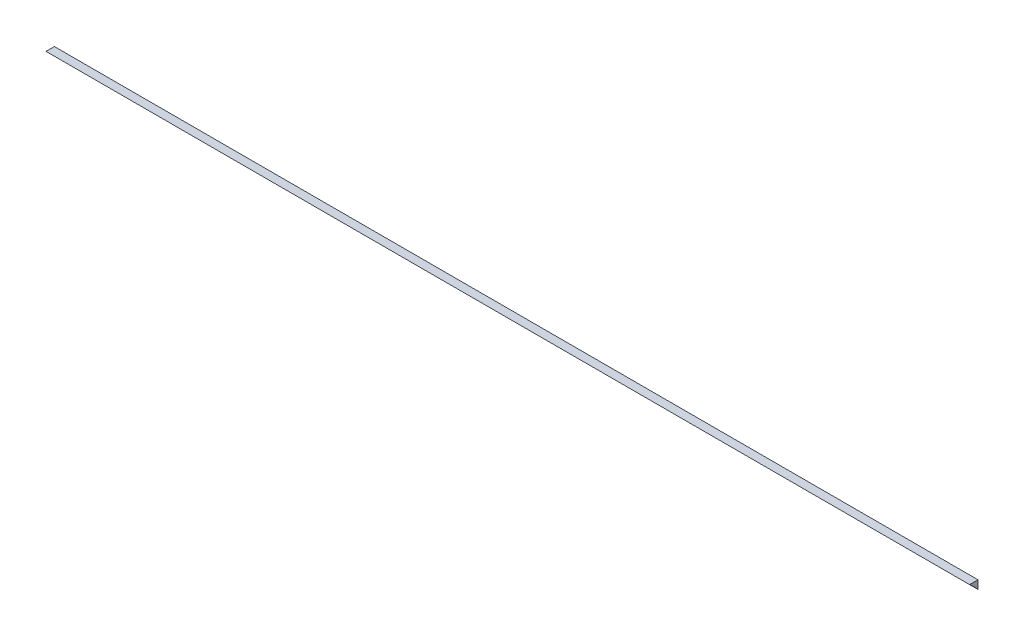
ISO-10303-21;
HEADER;
FILE_DESCRIPTION(('STEP AP214'),'2;1');
FILE_NAME('part.step','',(''),(''),'','','');
FILE_SCHEMA(('AUTOMOTIVE_DESIGN { 1 0 10303 214 1 1 1 1 }'));
ENDSEC;
DATA;
#1=APPLICATION_CONTEXT('core data for automotive mechanical design processes');
#2=APPLICATION_PROTOCOL_DEFINITION('international standard','automotive_design',2000,#1);
#3=PRODUCT_CONTEXT('',#1,'mechanical');
#4=PRODUCT('Part','Part','',(#3));
#5=PRODUCT_RELATED_PRODUCT_CATEGORY('part','',(#4));
#6=PRODUCT_DEFINITION_FORMATION('','',#4);
#7=PRODUCT_DEFINITION_CONTEXT('part definition',#1,'design');
#8=PRODUCT_DEFINITION('design','',#6,#7);
#9=PRODUCT_DEFINITION_SHAPE('','',#8);
#10=(LENGTH_UNIT() NAMED_UNIT(*) SI_UNIT(.MILLI.,.METRE.));
#11=(NAMED_UNIT(*) PLANE_ANGLE_UNIT() SI_UNIT($,.RADIAN.));
#12=(NAMED_UNIT(*) SI_UNIT($,.STERADIAN.) SOLID_ANGLE_UNIT());
#13=UNCERTAINTY_MEASURE_WITH_UNIT(LENGTH_MEASURE(1.E-05),#10,'distance_accuracy_value','');
#14=(GEOMETRIC_REPRESENTATION_CONTEXT(3) GLOBAL_UNCERTAINTY_ASSIGNED_CONTEXT((#13)) GLOBAL_UNIT_ASSIGNED_CONTEXT((#10,
#11,#12)) REPRESENTATION_CONTEXT('',''));
#15=CARTESIAN_POINT('',(0.,0.,0.));
#16=DIRECTION('',(0.,0.,1.));
#17=DIRECTION('',(1.,0.,0.));
#18=AXIS2_PLACEMENT_3D('',#15,#16,#17);
#19=CARTESIAN_POINT('',(1750.,-225.,0.));
#20=DIRECTION('',(0.,-1.,0.));
#21=DIRECTION('',(0.,0.,-1.));
#22=AXIS2_PLACEMENT_3D('',#19,#20,#21);
#23=PLANE('',#22);
#24=DIRECTION('',(0.,0.,-1.));
#25=VECTOR('',#24,1.);
#26=CARTESIAN_POINT('',(749.188317724915,-225.,-250.));
#27=LINE('',#26,#25);
#28=CARTESIAN_POINT('',(749.188317724913,-225.000000000034,10.0000000001));
#29=VERTEX_POINT('',#28);
#30=CARTESIAN_POINT('',(749.188317724915,-225.,0.));
#31=VERTEX_POINT('',#30);
#32=EDGE_CURVE('E107',#29,#31,#27,.T.);
#33=ORIENTED_EDGE('',*,*,#32,.T.);
#34=DIRECTION('',(-1.,0.,0.));
#35=VECTOR('',#34,1.);
#36=CARTESIAN_POINT('',(1750.,-225.,0.));
#37=LINE('',#36,#35);
#38=CARTESIAN_POINT('',(-350.811682275085,-225.,-1.38347986926614E-13));
#39=VERTEX_POINT('',#38);
#40=EDGE_CURVE('E87',#31,#39,#37,.T.);
#41=ORIENTED_EDGE('',*,*,#40,.T.);
#42=DIRECTION('',(0.,0.,-1.));
#43=VECTOR('',#42,1.);
#44=CARTESIAN_POINT('',(-350.811682275085,-225.,-2.3747764329489E-13));
#45=LINE('',#44,#43);
#46=CARTESIAN_POINT('',(-350.811682275087,-225.,9.99999999999984));
#47=VERTEX_POINT('',#46);
#48=EDGE_CURVE('E90',#47,#39,#45,.T.);
#49=ORIENTED_EDGE('',*,*,#48,.F.);
#50=DIRECTION('',(1.,0.,0.));
#51=VECTOR('',#50,1.);
#52=CARTESIAN_POINT('',(-350.811682275085,-225.,9.99999999999984));
#53=LINE('',#52,#51);
#54=EDGE_CURVE('E61',#29,#47,#53,.F.);
#55=ORIENTED_EDGE('',*,*,#54,.F.);
#56=EDGE_LOOP('',(#33,#41,#49,#55));
#57=FACE_BOUND('',#56,.T.);
#58=ADVANCED_FACE('F57',(#57),#23,.F.);
#59=CARTESIAN_POINT('',(749.188317724915,-300.622289771007,75.6222897710069));
#60=DIRECTION('',(-1.,0.,0.));
#61=DIRECTION('',(0.,0.,1.));
#62=AXIS2_PLACEMENT_3D('',#59,#60,#61);
#63=PLANE('',#62);
#64=DIRECTION('',(0.,1.,0.));
#65=VECTOR('',#64,1.);
#66=CARTESIAN_POINT('',(749.188317724915,-255.,0.));
#67=LINE('',#66,#65);
#68=CARTESIAN_POINT('',(749.188317724913,-235.000000000104,2.99552049831675E-11));
#69=VERTEX_POINT('',#68);
#70=EDGE_CURVE('E106',#69,#31,#67,.T.);
#71=ORIENTED_EDGE('',*,*,#70,.T.);
#72=ORIENTED_EDGE('',*,*,#32,.F.);
#73=CARTESIAN_POINT('',(749.188317724906,-300.622289771073,75.6222897710642));
#74=DIRECTION('',(1.,0.,0.));
#75=DIRECTION('',(0.,1.,0.));
#76=AXIS2_PLACEMENT_3D('',#73,#74,#75);
#77=CIRCLE('',#76,100.124999999997);
#78=EDGE_CURVE('E100',#69,#29,#77,.T.);
#79=ORIENTED_EDGE('',*,*,#78,.F.);
#80=EDGE_LOOP('',(#71,#72,#79));
#81=FACE_BOUND('',#80,.T.);
#82=ADVANCED_FACE('F121',(#81),#63,.F.);
#83=CARTESIAN_POINT('',(749.188317724915,-255.,0.));
#84=DIRECTION('',(0.,0.,1.));
#85=DIRECTION('',(0.,-1.,0.));
#86=AXIS2_PLACEMENT_3D('',#83,#84,#85);
#87=PLANE('',#86);
#88=DIRECTION('',(1.,0.,0.));
#89=VECTOR('',#88,1.);
#90=CARTESIAN_POINT('',(-350.811682275085,-235.,-2.35922392732846E-13));
#91=LINE('',#90,#89);
#92=CARTESIAN_POINT('',(-350.811682275087,-235.,-1.62925231674237E-13));
#93=VERTEX_POINT('',#92);
#94=EDGE_CURVE('E67',#93,#69,#91,.T.);
#95=ORIENTED_EDGE('',*,*,#94,.F.);
#96=DIRECTION('',(0.,-1.,0.));
#97=VECTOR('',#96,1.);
#98=CARTESIAN_POINT('',(-350.811682275085,-255.,-1.38222777807814E-13));
#99=LINE('',#98,#97);
#100=EDGE_CURVE('E94',#39,#93,#99,.T.);
#101=ORIENTED_EDGE('',*,*,#100,.F.);
#102=ORIENTED_EDGE('',*,*,#40,.F.);
#103=ORIENTED_EDGE('',*,*,#70,.F.);
#104=EDGE_LOOP('',(#95,#101,#102,#103));
#105=FACE_BOUND('',#104,.T.);
#106=ADVANCED_FACE('F123',(#105),#87,.F.);
#107=CARTESIAN_POINT('',(-350.811682275096,-300.622289771007,75.6222897710068));
#108=DIRECTION('',(-1.,0.,0.));
#109=DIRECTION('',(0.,-1.,0.));
#110=AXIS2_PLACEMENT_3D('',#107,#108,#109);
#111=PLANE('',#110);
#112=ORIENTED_EDGE('',*,*,#100,.T.);
#113=CARTESIAN_POINT('',(-350.811682275093,-300.622289771004,75.622289771004));
#114=DIRECTION('',(1.,0.,0.));
#115=DIRECTION('',(0.,1.,0.));
#116=AXIS2_PLACEMENT_3D('',#113,#114,#115);
#117=CIRCLE('',#116,100.124999999997);
#118=EDGE_CURVE('E12',#47,#93,#117,.F.);
#119=ORIENTED_EDGE('',*,*,#118,.F.);
#120=ORIENTED_EDGE('',*,*,#48,.T.);
#121=EDGE_LOOP('',(#112,#119,#120));
#122=FACE_BOUND('',#121,.T.);
#123=ADVANCED_FACE('F96',(#122),#111,.T.);
#124=CARTESIAN_POINT('',(-350.811682275093,-300.622289771004,75.622289771004));
#125=DIRECTION('',(1.,0.,0.));
#126=DIRECTION('',(0.,1.,0.));
#127=AXIS2_PLACEMENT_3D('',#124,#125,#126);
#128=CYLINDRICAL_SURFACE('',#127,100.124999999997);
#129=ORIENTED_EDGE('',*,*,#118,.T.);
#130=ORIENTED_EDGE('',*,*,#94,.T.);
#131=ORIENTED_EDGE('',*,*,#78,.T.);
#132=ORIENTED_EDGE('',*,*,#54,.T.);
#133=EDGE_LOOP('',(#129,#130,#131,#132));
#134=FACE_BOUND('',#133,.T.);
#135=ADVANCED_FACE('F59',(#134),#128,.F.);
#136=CLOSED_SHELL('',(#58,#82,#106,#123,#135));
#137=MANIFOLD_SOLID_BREP('B2',#136);
#138=ADVANCED_BREP_SHAPE_REPRESENTATION('',(#18,#137),#14);
#139=SHAPE_DEFINITION_REPRESENTATION(#9,#138);
ENDSEC;
END-ISO-10303-21;
